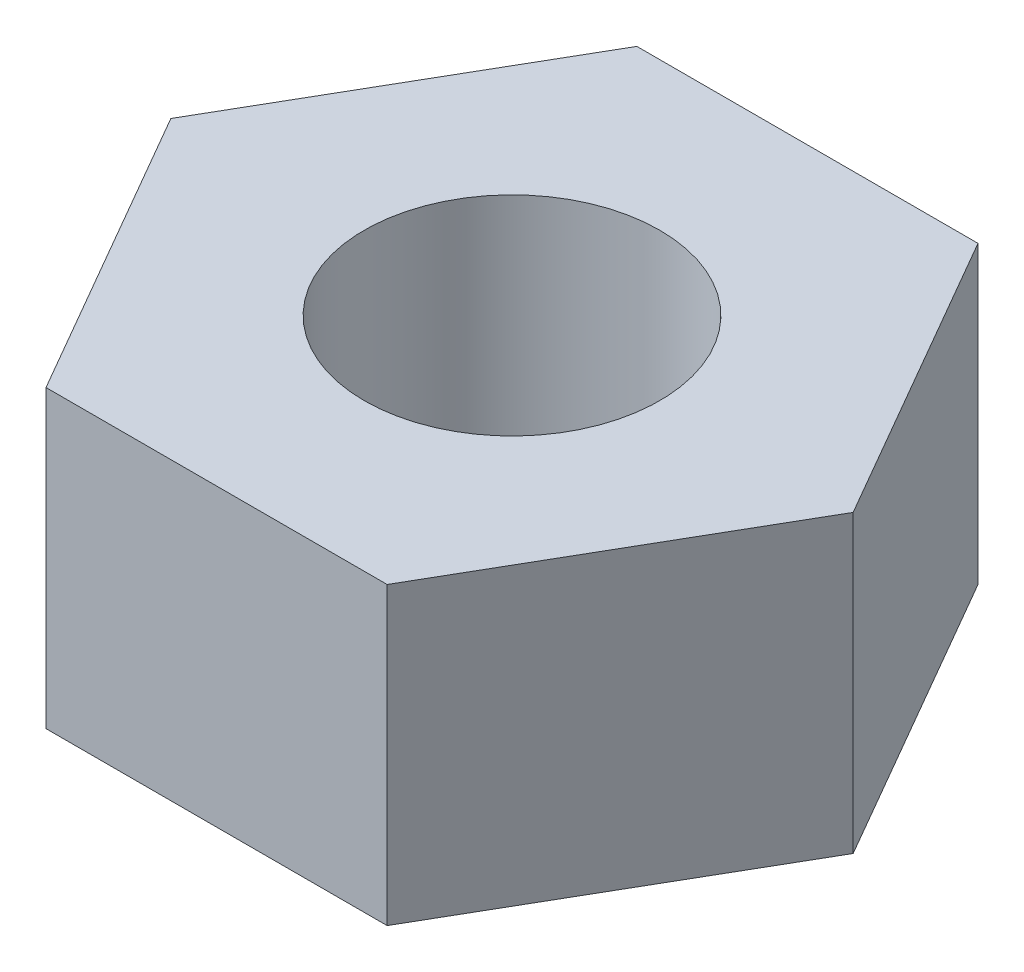
ISO-10303-21;
HEADER;
FILE_DESCRIPTION(('STEP AP214'),'2;1');
FILE_NAME('part.step','',(''),(''),'','','');
FILE_SCHEMA(('AUTOMOTIVE_DESIGN { 1 0 10303 214 1 1 1 1 }'));
ENDSEC;
DATA;
#1=APPLICATION_CONTEXT('core data for automotive mechanical design processes');
#2=APPLICATION_PROTOCOL_DEFINITION('international standard','automotive_design',2000,#1);
#3=PRODUCT_CONTEXT('',#1,'mechanical');
#4=PRODUCT('Part','Part','',(#3));
#5=PRODUCT_RELATED_PRODUCT_CATEGORY('part','',(#4));
#6=PRODUCT_DEFINITION_FORMATION('','',#4);
#7=PRODUCT_DEFINITION_CONTEXT('part definition',#1,'design');
#8=PRODUCT_DEFINITION('design','',#6,#7);
#9=PRODUCT_DEFINITION_SHAPE('','',#8);
#10=(LENGTH_UNIT() NAMED_UNIT(*) SI_UNIT(.MILLI.,.METRE.));
#11=(NAMED_UNIT(*) PLANE_ANGLE_UNIT() SI_UNIT($,.RADIAN.));
#12=(NAMED_UNIT(*) SI_UNIT($,.STERADIAN.) SOLID_ANGLE_UNIT());
#13=UNCERTAINTY_MEASURE_WITH_UNIT(LENGTH_MEASURE(1.E-05),#10,'distance_accuracy_value','');
#14=(GEOMETRIC_REPRESENTATION_CONTEXT(3) GLOBAL_UNCERTAINTY_ASSIGNED_CONTEXT((#13)) GLOBAL_UNIT_ASSIGNED_CONTEXT((#10,
#11,#12)) REPRESENTATION_CONTEXT('',''));
#15=CARTESIAN_POINT('',(0.,0.,0.));
#16=DIRECTION('',(0.,0.,1.));
#17=DIRECTION('',(1.,0.,0.));
#18=AXIS2_PLACEMENT_3D('',#15,#16,#17);
#19=CARTESIAN_POINT('',(0.,2.,0.));
#20=DIRECTION('',(0.,1.,0.));
#21=DIRECTION('',(0.,0.,1.));
#22=AXIS2_PLACEMENT_3D('',#19,#20,#21);
#23=PLANE('',#22);
#24=DIRECTION('',(-0.5,0.,-0.866025403784439));
#25=VECTOR('',#24,1.);
#26=CARTESIAN_POINT('',(4.61880215351701,2.,0.));
#27=LINE('',#26,#25);
#28=CARTESIAN_POINT('',(4.61880215351701,2.,0.));
#29=VERTEX_POINT('',#28);
#30=CARTESIAN_POINT('',(2.3094010767585,2.,-4.));
#31=VERTEX_POINT('',#30);
#32=EDGE_CURVE('E133',#29,#31,#27,.T.);
#33=ORIENTED_EDGE('',*,*,#32,.T.);
#34=DIRECTION('',(-1.,0.,0.));
#35=VECTOR('',#34,1.);
#36=CARTESIAN_POINT('',(2.3094010767585,2.,-4.));
#37=LINE('',#36,#35);
#38=CARTESIAN_POINT('',(-2.3094010767585,2.,-4.));
#39=VERTEX_POINT('',#38);
#40=EDGE_CURVE('E91',#31,#39,#37,.T.);
#41=ORIENTED_EDGE('',*,*,#40,.T.);
#42=DIRECTION('',(-0.5,0.,0.866025403784439));
#43=VECTOR('',#42,1.);
#44=CARTESIAN_POINT('',(-2.3094010767585,2.,-4.));
#45=LINE('',#44,#43);
#46=CARTESIAN_POINT('',(-4.618802153517,2.,0.));
#47=VERTEX_POINT('',#46);
#48=EDGE_CURVE('E104',#39,#47,#45,.T.);
#49=ORIENTED_EDGE('',*,*,#48,.T.);
#50=DIRECTION('',(0.5,0.,0.866025403784438));
#51=VECTOR('',#50,1.);
#52=CARTESIAN_POINT('',(-4.618802153517,2.,0.));
#53=LINE('',#52,#51);
#54=CARTESIAN_POINT('',(-2.3094010767585,2.,4.));
#55=VERTEX_POINT('',#54);
#56=EDGE_CURVE('E98',#47,#55,#53,.T.);
#57=ORIENTED_EDGE('',*,*,#56,.T.);
#58=DIRECTION('',(1.,0.,0.));
#59=VECTOR('',#58,1.);
#60=CARTESIAN_POINT('',(-2.3094010767585,2.,4.));
#61=LINE('',#60,#59);
#62=CARTESIAN_POINT('',(2.3094010767585,2.,4.));
#63=VERTEX_POINT('',#62);
#64=EDGE_CURVE('E102',#55,#63,#61,.T.);
#65=ORIENTED_EDGE('',*,*,#64,.T.);
#66=DIRECTION('',(0.5,0.,-0.866025403784439));
#67=VECTOR('',#66,1.);
#68=CARTESIAN_POINT('',(2.3094010767585,2.,4.));
#69=LINE('',#68,#67);
#70=EDGE_CURVE('E54',#63,#29,#69,.T.);
#71=ORIENTED_EDGE('',*,*,#70,.T.);
#72=EDGE_LOOP('',(#33,#41,#49,#57,#65,#71));
#73=FACE_BOUND('',#72,.T.);
#74=CARTESIAN_POINT('',(0.,2.,0.));
#75=DIRECTION('',(0.,1.,0.));
#76=DIRECTION('',(0.,0.,1.));
#77=AXIS2_PLACEMENT_3D('',#74,#75,#76);
#78=CIRCLE('',#77,2.);
#79=CARTESIAN_POINT('',(0.,2.,2.));
#80=VERTEX_POINT('',#79);
#81=EDGE_CURVE('E126',#80,#80,#78,.T.);
#82=ORIENTED_EDGE('',*,*,#81,.F.);
#83=EDGE_LOOP('',(#82));
#84=FACE_BOUND('',#83,.T.);
#85=ADVANCED_FACE('F37',(#73,#84),#23,.T.);
#86=CARTESIAN_POINT('',(0.,-2.,0.));
#87=DIRECTION('',(0.,1.,0.));
#88=DIRECTION('',(0.,0.,1.));
#89=AXIS2_PLACEMENT_3D('',#86,#87,#88);
#90=PLANE('',#89);
#91=DIRECTION('',(-0.5,0.,-0.866025403784439));
#92=VECTOR('',#91,1.);
#93=CARTESIAN_POINT('',(4.61880215351701,-2.,0.));
#94=LINE('',#93,#92);
#95=CARTESIAN_POINT('',(4.61880215351701,-2.,0.));
#96=VERTEX_POINT('',#95);
#97=CARTESIAN_POINT('',(2.3094010767585,-2.,-4.));
#98=VERTEX_POINT('',#97);
#99=EDGE_CURVE('E122',#96,#98,#94,.T.);
#100=ORIENTED_EDGE('',*,*,#99,.F.);
#101=DIRECTION('',(0.5,0.,-0.866025403784439));
#102=VECTOR('',#101,1.);
#103=CARTESIAN_POINT('',(2.3094010767585,-2.,4.));
#104=LINE('',#103,#102);
#105=CARTESIAN_POINT('',(2.3094010767585,-2.,4.));
#106=VERTEX_POINT('',#105);
#107=EDGE_CURVE('E83',#106,#96,#104,.T.);
#108=ORIENTED_EDGE('',*,*,#107,.F.);
#109=DIRECTION('',(1.,0.,0.));
#110=VECTOR('',#109,1.);
#111=CARTESIAN_POINT('',(-2.3094010767585,-2.,4.));
#112=LINE('',#111,#110);
#113=CARTESIAN_POINT('',(-2.3094010767585,-2.,4.));
#114=VERTEX_POINT('',#113);
#115=EDGE_CURVE('E77',#114,#106,#112,.T.);
#116=ORIENTED_EDGE('',*,*,#115,.F.);
#117=DIRECTION('',(0.5,0.,0.866025403784438));
#118=VECTOR('',#117,1.);
#119=CARTESIAN_POINT('',(-4.618802153517,-2.,0.));
#120=LINE('',#119,#118);
#121=CARTESIAN_POINT('',(-4.618802153517,-2.,0.));
#122=VERTEX_POINT('',#121);
#123=EDGE_CURVE('E112',#122,#114,#120,.T.);
#124=ORIENTED_EDGE('',*,*,#123,.F.);
#125=DIRECTION('',(-0.5,0.,0.866025403784439));
#126=VECTOR('',#125,1.);
#127=CARTESIAN_POINT('',(-2.3094010767585,-2.,-4.));
#128=LINE('',#127,#126);
#129=CARTESIAN_POINT('',(-2.3094010767585,-2.,-4.));
#130=VERTEX_POINT('',#129);
#131=EDGE_CURVE('E128',#130,#122,#128,.T.);
#132=ORIENTED_EDGE('',*,*,#131,.F.);
#133=DIRECTION('',(-1.,0.,0.));
#134=VECTOR('',#133,1.);
#135=CARTESIAN_POINT('',(2.3094010767585,-2.,-4.));
#136=LINE('',#135,#134);
#137=EDGE_CURVE('E125',#98,#130,#136,.T.);
#138=ORIENTED_EDGE('',*,*,#137,.F.);
#139=EDGE_LOOP('',(#100,#108,#116,#124,#132,#138));
#140=FACE_BOUND('',#139,.T.);
#141=CARTESIAN_POINT('',(0.,-2.,0.));
#142=DIRECTION('',(0.,1.,0.));
#143=DIRECTION('',(0.,0.,1.));
#144=AXIS2_PLACEMENT_3D('',#141,#142,#143);
#145=CIRCLE('',#144,2.);
#146=CARTESIAN_POINT('',(0.,-2.,2.));
#147=VERTEX_POINT('',#146);
#148=EDGE_CURVE('E226',#147,#147,#145,.T.);
#149=ORIENTED_EDGE('',*,*,#148,.T.);
#150=EDGE_LOOP('',(#149));
#151=FACE_BOUND('',#150,.T.);
#152=ADVANCED_FACE('F142',(#140,#151),#90,.F.);
#153=CARTESIAN_POINT('',(4.61880215351701,2.,0.));
#154=DIRECTION('',(-0.866025403784439,0.,0.5));
#155=DIRECTION('',(0.5,0.,0.866025403784439));
#156=AXIS2_PLACEMENT_3D('',#153,#154,#155);
#157=PLANE('',#156);
#158=ORIENTED_EDGE('',*,*,#99,.T.);
#159=DIRECTION('',(0.,-1.,0.));
#160=VECTOR('',#159,1.);
#161=CARTESIAN_POINT('',(2.3094010767585,2.,-4.));
#162=LINE('',#161,#160);
#163=EDGE_CURVE('E11',#31,#98,#162,.T.);
#164=ORIENTED_EDGE('',*,*,#163,.F.);
#165=ORIENTED_EDGE('',*,*,#32,.F.);
#166=DIRECTION('',(0.,-1.,0.));
#167=VECTOR('',#166,1.);
#168=CARTESIAN_POINT('',(4.61880215351701,2.,0.));
#169=LINE('',#168,#167);
#170=EDGE_CURVE('E118',#29,#96,#169,.T.);
#171=ORIENTED_EDGE('',*,*,#170,.T.);
#172=EDGE_LOOP('',(#158,#164,#165,#171));
#173=FACE_BOUND('',#172,.T.);
#174=ADVANCED_FACE('F39',(#173),#157,.F.);
#175=CARTESIAN_POINT('',(2.3094010767585,2.,-4.));
#176=DIRECTION('',(0.,0.,1.));
#177=DIRECTION('',(1.,0.,0.));
#178=AXIS2_PLACEMENT_3D('',#175,#176,#177);
#179=PLANE('',#178);
#180=ORIENTED_EDGE('',*,*,#137,.T.);
#181=DIRECTION('',(0.,-1.,0.));
#182=VECTOR('',#181,1.);
#183=CARTESIAN_POINT('',(-2.3094010767585,2.,-4.));
#184=LINE('',#183,#182);
#185=EDGE_CURVE('E46',#39,#130,#184,.T.);
#186=ORIENTED_EDGE('',*,*,#185,.F.);
#187=ORIENTED_EDGE('',*,*,#40,.F.);
#188=ORIENTED_EDGE('',*,*,#163,.T.);
#189=EDGE_LOOP('',(#180,#186,#187,#188));
#190=FACE_BOUND('',#189,.T.);
#191=ADVANCED_FACE('F167',(#190),#179,.F.);
#192=CARTESIAN_POINT('',(-2.3094010767585,2.,-4.));
#193=DIRECTION('',(0.866025403784439,0.,0.5));
#194=DIRECTION('',(0.5,0.,-0.866025403784439));
#195=AXIS2_PLACEMENT_3D('',#192,#193,#194);
#196=PLANE('',#195);
#197=ORIENTED_EDGE('',*,*,#131,.T.);
#198=DIRECTION('',(0.,-1.,0.));
#199=VECTOR('',#198,1.);
#200=CARTESIAN_POINT('',(-4.618802153517,2.,0.));
#201=LINE('',#200,#199);
#202=EDGE_CURVE('E113',#47,#122,#201,.T.);
#203=ORIENTED_EDGE('',*,*,#202,.F.);
#204=ORIENTED_EDGE('',*,*,#48,.F.);
#205=ORIENTED_EDGE('',*,*,#185,.T.);
#206=EDGE_LOOP('',(#197,#203,#204,#205));
#207=FACE_BOUND('',#206,.T.);
#208=ADVANCED_FACE('F139',(#207),#196,.F.);
#209=CARTESIAN_POINT('',(-4.618802153517,2.,0.));
#210=DIRECTION('',(0.866025403784438,0.,-0.5));
#211=DIRECTION('',(-0.5,0.,-0.866025403784439));
#212=AXIS2_PLACEMENT_3D('',#209,#210,#211);
#213=PLANE('',#212);
#214=ORIENTED_EDGE('',*,*,#123,.T.);
#215=DIRECTION('',(0.,-1.,0.));
#216=VECTOR('',#215,1.);
#217=CARTESIAN_POINT('',(-2.3094010767585,2.,4.));
#218=LINE('',#217,#216);
#219=EDGE_CURVE('E109',#55,#114,#218,.T.);
#220=ORIENTED_EDGE('',*,*,#219,.F.);
#221=ORIENTED_EDGE('',*,*,#56,.F.);
#222=ORIENTED_EDGE('',*,*,#202,.T.);
#223=EDGE_LOOP('',(#214,#220,#221,#222));
#224=FACE_BOUND('',#223,.T.);
#225=ADVANCED_FACE('F110',(#224),#213,.F.);
#226=CARTESIAN_POINT('',(-2.3094010767585,2.,4.));
#227=DIRECTION('',(0.,0.,-1.));
#228=DIRECTION('',(-1.,0.,0.));
#229=AXIS2_PLACEMENT_3D('',#226,#227,#228);
#230=PLANE('',#229);
#231=ORIENTED_EDGE('',*,*,#115,.T.);
#232=DIRECTION('',(0.,-1.,0.));
#233=VECTOR('',#232,1.);
#234=CARTESIAN_POINT('',(2.3094010767585,2.,4.));
#235=LINE('',#234,#233);
#236=EDGE_CURVE('E114',#63,#106,#235,.T.);
#237=ORIENTED_EDGE('',*,*,#236,.F.);
#238=ORIENTED_EDGE('',*,*,#64,.F.);
#239=ORIENTED_EDGE('',*,*,#219,.T.);
#240=EDGE_LOOP('',(#231,#237,#238,#239));
#241=FACE_BOUND('',#240,.T.);
#242=ADVANCED_FACE('F116',(#241),#230,.F.);
#243=CARTESIAN_POINT('',(2.3094010767585,2.,4.));
#244=DIRECTION('',(-0.866025403784439,0.,-0.5));
#245=DIRECTION('',(-0.5,0.,0.866025403784439));
#246=AXIS2_PLACEMENT_3D('',#243,#244,#245);
#247=PLANE('',#246);
#248=ORIENTED_EDGE('',*,*,#107,.T.);
#249=ORIENTED_EDGE('',*,*,#170,.F.);
#250=ORIENTED_EDGE('',*,*,#70,.F.);
#251=ORIENTED_EDGE('',*,*,#236,.T.);
#252=EDGE_LOOP('',(#248,#249,#250,#251));
#253=FACE_BOUND('',#252,.T.);
#254=ADVANCED_FACE('F147',(#253),#247,.F.);
#255=CARTESIAN_POINT('',(0.,2.,0.));
#256=DIRECTION('',(0.,-1.,0.));
#257=DIRECTION('',(0.,0.,-1.));
#258=AXIS2_PLACEMENT_3D('',#255,#256,#257);
#259=CYLINDRICAL_SURFACE('',#258,2.);
#260=ORIENTED_EDGE('',*,*,#81,.T.);
#261=EDGE_LOOP('',(#260));
#262=FACE_BOUND('',#261,.T.);
#263=ORIENTED_EDGE('',*,*,#148,.F.);
#264=EDGE_LOOP('',(#263));
#265=FACE_BOUND('',#264,.T.);
#266=ADVANCED_FACE('F149',(#262,#265),#259,.F.);
#267=CLOSED_SHELL('',(#85,#152,#174,#191,#208,#225,#242,#254,#266));
#268=MANIFOLD_SOLID_BREP('B2',#267);
#269=ADVANCED_BREP_SHAPE_REPRESENTATION('',(#18,#268),#14);
#270=SHAPE_DEFINITION_REPRESENTATION(#9,#269);
ENDSEC;
END-ISO-10303-21;
